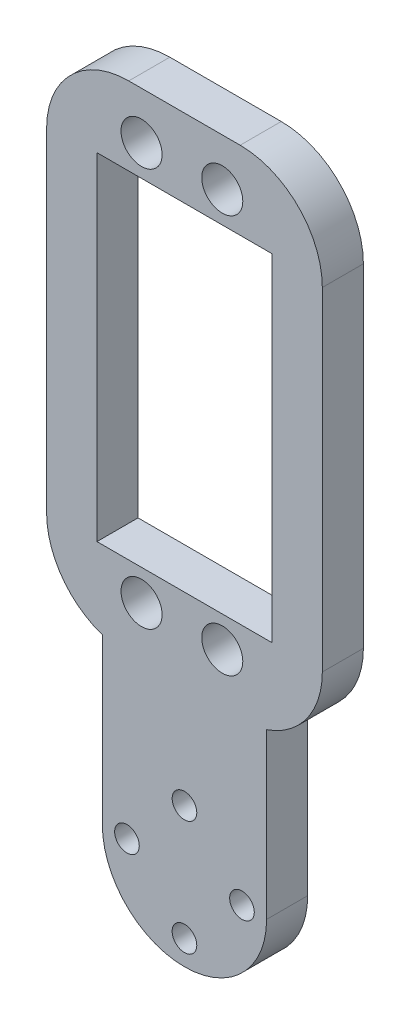
ISO-10303-21;
HEADER;
FILE_DESCRIPTION(('STEP AP214'),'2;1');
FILE_NAME('part.step','',(''),(''),'','','');
FILE_SCHEMA(('AUTOMOTIVE_DESIGN { 1 0 10303 214 1 1 1 1 }'));
ENDSEC;
DATA;
#1=APPLICATION_CONTEXT('core data for automotive mechanical design processes');
#2=APPLICATION_PROTOCOL_DEFINITION('international standard','automotive_design',2000,#1);
#3=PRODUCT_CONTEXT('',#1,'mechanical');
#4=PRODUCT('Part','Part','',(#3));
#5=PRODUCT_RELATED_PRODUCT_CATEGORY('part','',(#4));
#6=PRODUCT_DEFINITION_FORMATION('','',#4);
#7=PRODUCT_DEFINITION_CONTEXT('part definition',#1,'design');
#8=PRODUCT_DEFINITION('design','',#6,#7);
#9=PRODUCT_DEFINITION_SHAPE('','',#8);
#10=(LENGTH_UNIT() NAMED_UNIT(*) SI_UNIT(.MILLI.,.METRE.));
#11=(NAMED_UNIT(*) PLANE_ANGLE_UNIT() SI_UNIT($,.RADIAN.));
#12=(NAMED_UNIT(*) SI_UNIT($,.STERADIAN.) SOLID_ANGLE_UNIT());
#13=UNCERTAINTY_MEASURE_WITH_UNIT(LENGTH_MEASURE(1.E-05),#10,'distance_accuracy_value','');
#14=(GEOMETRIC_REPRESENTATION_CONTEXT(3) GLOBAL_UNCERTAINTY_ASSIGNED_CONTEXT((#13)) GLOBAL_UNIT_ASSIGNED_CONTEXT((#10,
#11,#12)) REPRESENTATION_CONTEXT('',''));
#15=CARTESIAN_POINT('',(0.,0.,0.));
#16=DIRECTION('',(0.,0.,1.));
#17=DIRECTION('',(1.,0.,0.));
#18=AXIS2_PLACEMENT_3D('',#15,#16,#17);
#19=CARTESIAN_POINT('',(-10.,0.,5.));
#20=DIRECTION('',(-1.,0.,0.));
#21=DIRECTION('',(0.,0.,1.));
#22=AXIS2_PLACEMENT_3D('',#19,#20,#21);
#23=PLANE('',#22);
#24=DIRECTION('',(0.,0.,1.));
#25=VECTOR('',#24,1.);
#26=CARTESIAN_POINT('',(-10.,20.,5.));
#27=LINE('',#26,#25);
#28=CARTESIAN_POINT('',(-10.,20.,0.));
#29=VERTEX_POINT('',#28);
#30=CARTESIAN_POINT('',(-10.,20.,5.));
#31=VERTEX_POINT('',#30);
#32=EDGE_CURVE('E210',#29,#31,#27,.T.);
#33=ORIENTED_EDGE('',*,*,#32,.F.);
#34=DIRECTION('',(0.,1.,0.));
#35=VECTOR('',#34,1.);
#36=CARTESIAN_POINT('',(-10.,0.,0.));
#37=LINE('',#36,#35);
#38=CARTESIAN_POINT('',(-10.,0.,0.));
#39=VERTEX_POINT('',#38);
#40=EDGE_CURVE('E241',#39,#29,#37,.T.);
#41=ORIENTED_EDGE('',*,*,#40,.F.);
#42=DIRECTION('',(0.,0.,-1.));
#43=VECTOR('',#42,1.);
#44=CARTESIAN_POINT('',(-10.,0.,5.));
#45=LINE('',#44,#43);
#46=CARTESIAN_POINT('',(-10.,0.,5.));
#47=VERTEX_POINT('',#46);
#48=EDGE_CURVE('E253',#47,#39,#45,.T.);
#49=ORIENTED_EDGE('',*,*,#48,.F.);
#50=DIRECTION('',(0.,1.,0.));
#51=VECTOR('',#50,1.);
#52=CARTESIAN_POINT('',(-10.,0.,5.));
#53=LINE('',#52,#51);
#54=EDGE_CURVE('E228',#47,#31,#53,.T.);
#55=ORIENTED_EDGE('',*,*,#54,.T.);
#56=EDGE_LOOP('',(#33,#41,#49,#55));
#57=FACE_BOUND('',#56,.T.);
#58=ADVANCED_FACE('F36',(#57),#23,.T.);
#59=CARTESIAN_POINT('',(0.,0.,5.));
#60=DIRECTION('',(0.,0.,-1.));
#61=DIRECTION('',(-1.,0.,0.));
#62=AXIS2_PLACEMENT_3D('',#59,#60,#61);
#63=CYLINDRICAL_SURFACE('',#62,10.);
#64=CARTESIAN_POINT('',(0.,0.,0.));
#65=DIRECTION('',(0.,0.,1.));
#66=DIRECTION('',(1.,0.,0.));
#67=AXIS2_PLACEMENT_3D('',#64,#65,#66);
#68=CIRCLE('',#67,10.);
#69=CARTESIAN_POINT('',(10.,0.,0.));
#70=VERTEX_POINT('',#69);
#71=EDGE_CURVE('E244',#39,#70,#68,.T.);
#72=ORIENTED_EDGE('',*,*,#71,.T.);
#73=DIRECTION('',(0.,0.,-1.));
#74=VECTOR('',#73,1.);
#75=CARTESIAN_POINT('',(10.,0.,5.));
#76=LINE('',#75,#74);
#77=CARTESIAN_POINT('',(10.,0.,5.));
#78=VERTEX_POINT('',#77);
#79=EDGE_CURVE('E240',#78,#70,#76,.T.);
#80=ORIENTED_EDGE('',*,*,#79,.F.);
#81=CARTESIAN_POINT('',(0.,0.,5.));
#82=DIRECTION('',(0.,0.,1.));
#83=DIRECTION('',(1.,0.,0.));
#84=AXIS2_PLACEMENT_3D('',#81,#82,#83);
#85=CIRCLE('',#84,10.);
#86=EDGE_CURVE('E231',#47,#78,#85,.T.);
#87=ORIENTED_EDGE('',*,*,#86,.F.);
#88=ORIENTED_EDGE('',*,*,#48,.T.);
#89=EDGE_LOOP('',(#72,#80,#87,#88));
#90=FACE_BOUND('',#89,.T.);
#91=ADVANCED_FACE('F329',(#90),#63,.T.);
#92=CARTESIAN_POINT('',(10.,0.,5.));
#93=DIRECTION('',(-1.,0.,0.));
#94=DIRECTION('',(0.,0.,1.));
#95=AXIS2_PLACEMENT_3D('',#92,#93,#94);
#96=PLANE('',#95);
#97=DIRECTION('',(0.,1.,0.));
#98=VECTOR('',#97,1.);
#99=CARTESIAN_POINT('',(10.,0.,0.));
#100=LINE('',#99,#98);
#101=CARTESIAN_POINT('',(10.,20.,0.));
#102=VERTEX_POINT('',#101);
#103=EDGE_CURVE('E246',#70,#102,#100,.T.);
#104=ORIENTED_EDGE('',*,*,#103,.T.);
#105=DIRECTION('',(0.,0.,1.));
#106=VECTOR('',#105,1.);
#107=CARTESIAN_POINT('',(10.,20.,5.));
#108=LINE('',#107,#106);
#109=CARTESIAN_POINT('',(10.,20.,5.));
#110=VERTEX_POINT('',#109);
#111=EDGE_CURVE('E203',#102,#110,#108,.T.);
#112=ORIENTED_EDGE('',*,*,#111,.T.);
#113=DIRECTION('',(0.,1.,0.));
#114=VECTOR('',#113,1.);
#115=CARTESIAN_POINT('',(10.,0.,5.));
#116=LINE('',#115,#114);
#117=EDGE_CURVE('E234',#78,#110,#116,.T.);
#118=ORIENTED_EDGE('',*,*,#117,.F.);
#119=ORIENTED_EDGE('',*,*,#79,.T.);
#120=EDGE_LOOP('',(#104,#112,#118,#119));
#121=FACE_BOUND('',#120,.T.);
#122=ADVANCED_FACE('F324',(#121),#96,.F.);
#123=CARTESIAN_POINT('',(0.,80.,5.));
#124=DIRECTION('',(0.,1.,0.));
#125=DIRECTION('',(0.,0.,1.));
#126=AXIS2_PLACEMENT_3D('',#123,#124,#125);
#127=PLANE('',#126);
#128=DIRECTION('',(1.,0.,0.));
#129=VECTOR('',#128,1.);
#130=CARTESIAN_POINT('',(0.,80.,5.));
#131=LINE('',#130,#129);
#132=CARTESIAN_POINT('',(-6.78000000000165,80.,5.));
#133=VERTEX_POINT('',#132);
#134=CARTESIAN_POINT('',(6.77999999999835,80.,5.));
#135=VERTEX_POINT('',#134);
#136=EDGE_CURVE('E237',#133,#135,#131,.T.);
#137=ORIENTED_EDGE('',*,*,#136,.T.);
#138=DIRECTION('',(0.,0.,1.));
#139=VECTOR('',#138,1.);
#140=CARTESIAN_POINT('',(6.77999999999835,80.,5.));
#141=LINE('',#140,#139);
#142=CARTESIAN_POINT('',(6.77999999999835,80.,0.));
#143=VERTEX_POINT('',#142);
#144=EDGE_CURVE('E280',#135,#143,#141,.F.);
#145=ORIENTED_EDGE('',*,*,#144,.T.);
#146=DIRECTION('',(1.,0.,0.));
#147=VECTOR('',#146,1.);
#148=CARTESIAN_POINT('',(0.,80.,0.));
#149=LINE('',#148,#147);
#150=CARTESIAN_POINT('',(-6.78000000000165,80.,0.));
#151=VERTEX_POINT('',#150);
#152=EDGE_CURVE('E232',#151,#143,#149,.T.);
#153=ORIENTED_EDGE('',*,*,#152,.F.);
#154=DIRECTION('',(0.,0.,1.));
#155=VECTOR('',#154,1.);
#156=CARTESIAN_POINT('',(-6.78000000000165,80.,5.));
#157=LINE('',#156,#155);
#158=EDGE_CURVE('E277',#151,#133,#157,.T.);
#159=ORIENTED_EDGE('',*,*,#158,.T.);
#160=EDGE_LOOP('',(#137,#145,#153,#159));
#161=FACE_BOUND('',#160,.T.);
#162=ADVANCED_FACE('F303',(#161),#127,.T.);
#163=CARTESIAN_POINT('',(0.,0.,5.));
#164=DIRECTION('',(0.,0.,1.));
#165=DIRECTION('',(1.,0.,0.));
#166=AXIS2_PLACEMENT_3D('',#163,#164,#165);
#167=PLANE('',#166);
#168=DIRECTION('',(1.,0.,0.));
#169=VECTOR('',#168,1.);
#170=CARTESIAN_POINT('',(10.6500000000003,29.5,5.));
#171=LINE('',#170,#169);
#172=CARTESIAN_POINT('',(-10.6499999999997,29.5,5.));
#173=VERTEX_POINT('',#172);
#174=CARTESIAN_POINT('',(10.6500000000003,29.5,5.));
#175=VERTEX_POINT('',#174);
#176=EDGE_CURVE('E51',#173,#175,#171,.T.);
#177=ORIENTED_EDGE('',*,*,#176,.F.);
#178=DIRECTION('',(0.,-1.,0.));
#179=VECTOR('',#178,1.);
#180=CARTESIAN_POINT('',(-10.6499999999997,29.5,5.));
#181=LINE('',#180,#179);
#182=CARTESIAN_POINT('',(-10.6499999999997,70.5,5.));
#183=VERTEX_POINT('',#182);
#184=EDGE_CURVE('E155',#183,#173,#181,.T.);
#185=ORIENTED_EDGE('',*,*,#184,.F.);
#186=DIRECTION('',(-1.,0.,0.));
#187=VECTOR('',#186,1.);
#188=CARTESIAN_POINT('',(10.6500000000003,70.5,5.));
#189=LINE('',#188,#187);
#190=CARTESIAN_POINT('',(10.6500000000003,70.5,5.));
#191=VERTEX_POINT('',#190);
#192=EDGE_CURVE('E158',#191,#183,#189,.T.);
#193=ORIENTED_EDGE('',*,*,#192,.F.);
#194=DIRECTION('',(0.,1.,0.));
#195=VECTOR('',#194,1.);
#196=CARTESIAN_POINT('',(10.6500000000003,29.5,5.));
#197=LINE('',#196,#195);
#198=EDGE_CURVE('E167',#175,#191,#197,.T.);
#199=ORIENTED_EDGE('',*,*,#198,.F.);
#200=EDGE_LOOP('',(#177,#185,#193,#199));
#201=FACE_BOUND('',#200,.T.);
#202=CARTESIAN_POINT('',(4.60000000000069,25.75,5.));
#203=DIRECTION('',(0.,0.,1.));
#204=DIRECTION('',(1.,0.,0.));
#205=AXIS2_PLACEMENT_3D('',#202,#203,#204);
#206=CIRCLE('',#205,2.50000000000012);
#207=CARTESIAN_POINT('',(7.10000000000081,25.75,5.));
#208=VERTEX_POINT('',#207);
#209=EDGE_CURVE('E161',#208,#208,#206,.T.);
#210=ORIENTED_EDGE('',*,*,#209,.F.);
#211=EDGE_LOOP('',(#210));
#212=FACE_BOUND('',#211,.T.);
#213=CARTESIAN_POINT('',(-5.22372370985057,25.75,5.));
#214=DIRECTION('',(0.,0.,1.));
#215=DIRECTION('',(1.,0.,0.));
#216=AXIS2_PLACEMENT_3D('',#213,#214,#215);
#217=CIRCLE('',#216,2.5);
#218=CARTESIAN_POINT('',(-2.72372370985057,25.75,5.));
#219=VERTEX_POINT('',#218);
#220=EDGE_CURVE('E186',#219,#219,#217,.T.);
#221=ORIENTED_EDGE('',*,*,#220,.F.);
#222=EDGE_LOOP('',(#221));
#223=FACE_BOUND('',#222,.T.);
#224=CARTESIAN_POINT('',(-5.22372370985057,74.25,5.));
#225=DIRECTION('',(0.,0.,1.));
#226=DIRECTION('',(1.,0.,0.));
#227=AXIS2_PLACEMENT_3D('',#224,#225,#226);
#228=CIRCLE('',#227,2.49999999999999);
#229=CARTESIAN_POINT('',(-2.72372370985058,74.25,5.));
#230=VERTEX_POINT('',#229);
#231=EDGE_CURVE('E180',#230,#230,#228,.T.);
#232=ORIENTED_EDGE('',*,*,#231,.F.);
#233=EDGE_LOOP('',(#232));
#234=FACE_BOUND('',#233,.T.);
#235=CARTESIAN_POINT('',(4.60000000000069,74.25,5.));
#236=DIRECTION('',(0.,0.,1.));
#237=DIRECTION('',(1.,0.,0.));
#238=AXIS2_PLACEMENT_3D('',#235,#236,#237);
#239=CIRCLE('',#238,2.50000000000001);
#240=CARTESIAN_POINT('',(7.10000000000069,74.25,5.));
#241=VERTEX_POINT('',#240);
#242=EDGE_CURVE('E179',#241,#241,#239,.T.);
#243=ORIENTED_EDGE('',*,*,#242,.F.);
#244=EDGE_LOOP('',(#243));
#245=FACE_BOUND('',#244,.T.);
#246=DIRECTION('',(0.,1.,0.));
#247=VECTOR('',#246,1.);
#248=CARTESIAN_POINT('',(16.7799999999983,80.,5.));
#249=LINE('',#248,#247);
#250=CARTESIAN_POINT('',(16.7799999999983,29.4673966854669,5.));
#251=VERTEX_POINT('',#250);
#252=CARTESIAN_POINT('',(16.7799999999983,70.,5.));
#253=VERTEX_POINT('',#252);
#254=EDGE_CURVE('E193',#251,#253,#249,.T.);
#255=ORIENTED_EDGE('',*,*,#254,.T.);
#256=CARTESIAN_POINT('',(6.77999999999835,70.,5.));
#257=DIRECTION('',(0.,0.,1.));
#258=DIRECTION('',(1.,0.,0.));
#259=AXIS2_PLACEMENT_3D('',#256,#257,#258);
#260=CIRCLE('',#259,10.);
#261=EDGE_CURVE('E275',#253,#135,#260,.T.);
#262=ORIENTED_EDGE('',*,*,#261,.T.);
#263=ORIENTED_EDGE('',*,*,#136,.F.);
#264=CARTESIAN_POINT('',(-6.78000000000165,70.,5.));
#265=DIRECTION('',(0.,0.,1.));
#266=DIRECTION('',(1.,0.,0.));
#267=AXIS2_PLACEMENT_3D('',#264,#265,#266);
#268=CIRCLE('',#267,10.);
#269=CARTESIAN_POINT('',(-16.7800000000017,70.,5.));
#270=VERTEX_POINT('',#269);
#271=EDGE_CURVE('E269',#133,#270,#268,.T.);
#272=ORIENTED_EDGE('',*,*,#271,.T.);
#273=DIRECTION('',(0.,-1.,0.));
#274=VECTOR('',#273,1.);
#275=CARTESIAN_POINT('',(-16.7800000000017,80.,5.));
#276=LINE('',#275,#274);
#277=CARTESIAN_POINT('',(-16.7800000000016,29.467396685468,5.));
#278=VERTEX_POINT('',#277);
#279=EDGE_CURVE('E200',#270,#278,#276,.T.);
#280=ORIENTED_EDGE('',*,*,#279,.T.);
#281=CARTESIAN_POINT('',(-6.78000000000165,29.467396685468,5.));
#282=DIRECTION('',(0.,0.,1.));
#283=DIRECTION('',(1.,0.,0.));
#284=AXIS2_PLACEMENT_3D('',#281,#282,#283);
#285=CIRCLE('',#284,10.);
#286=EDGE_CURVE('E271',#278,#31,#285,.T.);
#287=ORIENTED_EDGE('',*,*,#286,.T.);
#288=ORIENTED_EDGE('',*,*,#54,.F.);
#289=ORIENTED_EDGE('',*,*,#86,.T.);
#290=ORIENTED_EDGE('',*,*,#117,.T.);
#291=CARTESIAN_POINT('',(6.77999999999835,29.4673966854669,5.));
#292=DIRECTION('',(0.,0.,1.));
#293=DIRECTION('',(1.,0.,0.));
#294=AXIS2_PLACEMENT_3D('',#291,#292,#293);
#295=CIRCLE('',#294,10.);
#296=EDGE_CURVE('E273',#110,#251,#295,.T.);
#297=ORIENTED_EDGE('',*,*,#296,.T.);
#298=EDGE_LOOP('',(#255,#262,#263,#272,#280,#287,#288,#289,#290,#297));
#299=FACE_BOUND('',#298,.T.);
#300=CARTESIAN_POINT('',(7.,0.,5.));
#301=DIRECTION('',(0.,0.,1.));
#302=DIRECTION('',(1.,0.,0.));
#303=AXIS2_PLACEMENT_3D('',#300,#301,#302);
#304=CIRCLE('',#303,1.50000000000002);
#305=CARTESIAN_POINT('',(8.50000000000002,0.,5.));
#306=VERTEX_POINT('',#305);
#307=EDGE_CURVE('E214',#306,#306,#304,.T.);
#308=ORIENTED_EDGE('',*,*,#307,.F.);
#309=EDGE_LOOP('',(#308));
#310=FACE_BOUND('',#309,.T.);
#311=CARTESIAN_POINT('',(0.,-7.,5.));
#312=DIRECTION('',(0.,0.,1.));
#313=DIRECTION('',(1.,0.,0.));
#314=AXIS2_PLACEMENT_3D('',#311,#312,#313);
#315=CIRCLE('',#314,1.50000000000005);
#316=CARTESIAN_POINT('',(1.50000000000005,-7.,5.));
#317=VERTEX_POINT('',#316);
#318=EDGE_CURVE('E218',#317,#317,#315,.T.);
#319=ORIENTED_EDGE('',*,*,#318,.F.);
#320=EDGE_LOOP('',(#319));
#321=FACE_BOUND('',#320,.T.);
#322=CARTESIAN_POINT('',(-7.,0.,5.));
#323=DIRECTION('',(0.,0.,1.));
#324=DIRECTION('',(1.,0.,0.));
#325=AXIS2_PLACEMENT_3D('',#322,#323,#324);
#326=CIRCLE('',#325,1.50000000000007);
#327=CARTESIAN_POINT('',(-5.49999999999993,0.,5.));
#328=VERTEX_POINT('',#327);
#329=EDGE_CURVE('E213',#328,#328,#326,.T.);
#330=ORIENTED_EDGE('',*,*,#329,.F.);
#331=EDGE_LOOP('',(#330));
#332=FACE_BOUND('',#331,.T.);
#333=CARTESIAN_POINT('',(0.,7.,5.));
#334=DIRECTION('',(0.,0.,1.));
#335=DIRECTION('',(1.,0.,0.));
#336=AXIS2_PLACEMENT_3D('',#333,#334,#335);
#337=CIRCLE('',#336,1.5);
#338=CARTESIAN_POINT('',(1.5,7.,5.));
#339=VERTEX_POINT('',#338);
#340=EDGE_CURVE('E223',#339,#339,#337,.T.);
#341=ORIENTED_EDGE('',*,*,#340,.F.);
#342=EDGE_LOOP('',(#341));
#343=FACE_BOUND('',#342,.T.);
#344=ADVANCED_FACE('F306',(#201,#212,#223,#234,#245,#299,#310,#321,#332,#343),#167,.T.);
#345=CARTESIAN_POINT('',(0.,0.,0.));
#346=DIRECTION('',(0.,0.,1.));
#347=DIRECTION('',(1.,0.,0.));
#348=AXIS2_PLACEMENT_3D('',#345,#346,#347);
#349=PLANE('',#348);
#350=DIRECTION('',(0.,-1.,0.));
#351=VECTOR('',#350,1.);
#352=CARTESIAN_POINT('',(-10.6499999999997,29.5,0.));
#353=LINE('',#352,#351);
#354=CARTESIAN_POINT('',(-10.6499999999997,70.5,0.));
#355=VERTEX_POINT('',#354);
#356=CARTESIAN_POINT('',(-10.6499999999997,29.5,0.));
#357=VERTEX_POINT('',#356);
#358=EDGE_CURVE('E145',#355,#357,#353,.T.);
#359=ORIENTED_EDGE('',*,*,#358,.T.);
#360=DIRECTION('',(1.,0.,0.));
#361=VECTOR('',#360,1.);
#362=CARTESIAN_POINT('',(10.6500000000003,29.5,0.));
#363=LINE('',#362,#361);
#364=CARTESIAN_POINT('',(10.6500000000003,29.5,0.));
#365=VERTEX_POINT('',#364);
#366=EDGE_CURVE('E139',#357,#365,#363,.T.);
#367=ORIENTED_EDGE('',*,*,#366,.T.);
#368=DIRECTION('',(0.,1.,0.));
#369=VECTOR('',#368,1.);
#370=CARTESIAN_POINT('',(10.6500000000003,29.5,0.));
#371=LINE('',#370,#369);
#372=CARTESIAN_POINT('',(10.6500000000003,70.5,0.));
#373=VERTEX_POINT('',#372);
#374=EDGE_CURVE('E148',#365,#373,#371,.T.);
#375=ORIENTED_EDGE('',*,*,#374,.T.);
#376=DIRECTION('',(-1.,0.,0.));
#377=VECTOR('',#376,1.);
#378=CARTESIAN_POINT('',(10.6500000000003,70.5,0.));
#379=LINE('',#378,#377);
#380=EDGE_CURVE('E59',#373,#355,#379,.T.);
#381=ORIENTED_EDGE('',*,*,#380,.T.);
#382=EDGE_LOOP('',(#359,#367,#375,#381));
#383=FACE_BOUND('',#382,.T.);
#384=CARTESIAN_POINT('',(4.60000000000069,25.75,0.));
#385=DIRECTION('',(0.,0.,1.));
#386=DIRECTION('',(1.,0.,0.));
#387=AXIS2_PLACEMENT_3D('',#384,#385,#386);
#388=CIRCLE('',#387,2.50000000000012);
#389=CARTESIAN_POINT('',(7.10000000000081,25.75,0.));
#390=VERTEX_POINT('',#389);
#391=EDGE_CURVE('E189',#390,#390,#388,.T.);
#392=ORIENTED_EDGE('',*,*,#391,.T.);
#393=EDGE_LOOP('',(#392));
#394=FACE_BOUND('',#393,.T.);
#395=CARTESIAN_POINT('',(-5.22372370985057,25.75,0.));
#396=DIRECTION('',(0.,0.,1.));
#397=DIRECTION('',(1.,0.,0.));
#398=AXIS2_PLACEMENT_3D('',#395,#396,#397);
#399=CIRCLE('',#398,2.5);
#400=CARTESIAN_POINT('',(-2.72372370985057,25.75,0.));
#401=VERTEX_POINT('',#400);
#402=EDGE_CURVE('E183',#401,#401,#399,.T.);
#403=ORIENTED_EDGE('',*,*,#402,.T.);
#404=EDGE_LOOP('',(#403));
#405=FACE_BOUND('',#404,.T.);
#406=CARTESIAN_POINT('',(-5.22372370985057,74.25,0.));
#407=DIRECTION('',(0.,0.,1.));
#408=DIRECTION('',(1.,0.,0.));
#409=AXIS2_PLACEMENT_3D('',#406,#407,#408);
#410=CIRCLE('',#409,2.49999999999999);
#411=CARTESIAN_POINT('',(-2.72372370985058,74.25,0.));
#412=VERTEX_POINT('',#411);
#413=EDGE_CURVE('E176',#412,#412,#410,.T.);
#414=ORIENTED_EDGE('',*,*,#413,.T.);
#415=EDGE_LOOP('',(#414));
#416=FACE_BOUND('',#415,.T.);
#417=CARTESIAN_POINT('',(4.60000000000069,74.25,0.));
#418=DIRECTION('',(0.,0.,1.));
#419=DIRECTION('',(1.,0.,0.));
#420=AXIS2_PLACEMENT_3D('',#417,#418,#419);
#421=CIRCLE('',#420,2.50000000000001);
#422=CARTESIAN_POINT('',(7.10000000000069,74.25,0.));
#423=VERTEX_POINT('',#422);
#424=EDGE_CURVE('E190',#423,#423,#421,.T.);
#425=ORIENTED_EDGE('',*,*,#424,.T.);
#426=EDGE_LOOP('',(#425));
#427=FACE_BOUND('',#426,.T.);
#428=CARTESIAN_POINT('',(7.,0.,0.));
#429=DIRECTION('',(0.,0.,1.));
#430=DIRECTION('',(1.,0.,0.));
#431=AXIS2_PLACEMENT_3D('',#428,#429,#430);
#432=CIRCLE('',#431,1.50000000000002);
#433=CARTESIAN_POINT('',(8.50000000000002,0.,0.));
#434=VERTEX_POINT('',#433);
#435=EDGE_CURVE('E227',#434,#434,#432,.T.);
#436=ORIENTED_EDGE('',*,*,#435,.T.);
#437=EDGE_LOOP('',(#436));
#438=FACE_BOUND('',#437,.T.);
#439=CARTESIAN_POINT('',(0.,-7.,0.));
#440=DIRECTION('',(0.,0.,1.));
#441=DIRECTION('',(1.,0.,0.));
#442=AXIS2_PLACEMENT_3D('',#439,#440,#441);
#443=CIRCLE('',#442,1.50000000000005);
#444=CARTESIAN_POINT('',(1.50000000000005,-7.,0.));
#445=VERTEX_POINT('',#444);
#446=EDGE_CURVE('E260',#445,#445,#443,.T.);
#447=ORIENTED_EDGE('',*,*,#446,.T.);
#448=EDGE_LOOP('',(#447));
#449=FACE_BOUND('',#448,.T.);
#450=CARTESIAN_POINT('',(-7.,0.,0.));
#451=DIRECTION('',(0.,0.,1.));
#452=DIRECTION('',(1.,0.,0.));
#453=AXIS2_PLACEMENT_3D('',#450,#451,#452);
#454=CIRCLE('',#453,1.50000000000007);
#455=CARTESIAN_POINT('',(-5.49999999999993,0.,0.));
#456=VERTEX_POINT('',#455);
#457=EDGE_CURVE('E217',#456,#456,#454,.T.);
#458=ORIENTED_EDGE('',*,*,#457,.T.);
#459=EDGE_LOOP('',(#458));
#460=FACE_BOUND('',#459,.T.);
#461=CARTESIAN_POINT('',(0.,7.,0.));
#462=DIRECTION('',(0.,0.,1.));
#463=DIRECTION('',(1.,0.,0.));
#464=AXIS2_PLACEMENT_3D('',#461,#462,#463);
#465=CIRCLE('',#464,1.5);
#466=CARTESIAN_POINT('',(1.5,7.,0.));
#467=VERTEX_POINT('',#466);
#468=EDGE_CURVE('E226',#467,#467,#465,.T.);
#469=ORIENTED_EDGE('',*,*,#468,.T.);
#470=EDGE_LOOP('',(#469));
#471=FACE_BOUND('',#470,.T.);
#472=ORIENTED_EDGE('',*,*,#152,.T.);
#473=CARTESIAN_POINT('',(6.77999999999835,70.,0.));
#474=DIRECTION('',(0.,0.,1.));
#475=DIRECTION('',(1.,0.,0.));
#476=AXIS2_PLACEMENT_3D('',#473,#474,#475);
#477=CIRCLE('',#476,10.);
#478=CARTESIAN_POINT('',(16.7799999999983,70.,0.));
#479=VERTEX_POINT('',#478);
#480=EDGE_CURVE('E288',#143,#479,#477,.F.);
#481=ORIENTED_EDGE('',*,*,#480,.T.);
#482=DIRECTION('',(0.,1.,0.));
#483=VECTOR('',#482,1.);
#484=CARTESIAN_POINT('',(16.7799999999983,80.,0.));
#485=LINE('',#484,#483);
#486=CARTESIAN_POINT('',(16.7799999999983,29.4673966854669,0.));
#487=VERTEX_POINT('',#486);
#488=EDGE_CURVE('E196',#487,#479,#485,.T.);
#489=ORIENTED_EDGE('',*,*,#488,.F.);
#490=CARTESIAN_POINT('',(6.77999999999835,29.4673966854669,0.));
#491=DIRECTION('',(0.,0.,1.));
#492=DIRECTION('',(1.,0.,0.));
#493=AXIS2_PLACEMENT_3D('',#490,#491,#492);
#494=CIRCLE('',#493,10.);
#495=EDGE_CURVE('E286',#487,#102,#494,.F.);
#496=ORIENTED_EDGE('',*,*,#495,.T.);
#497=ORIENTED_EDGE('',*,*,#103,.F.);
#498=ORIENTED_EDGE('',*,*,#71,.F.);
#499=ORIENTED_EDGE('',*,*,#40,.T.);
#500=CARTESIAN_POINT('',(-6.78000000000165,29.467396685468,0.));
#501=DIRECTION('',(0.,0.,1.));
#502=DIRECTION('',(1.,0.,0.));
#503=AXIS2_PLACEMENT_3D('',#500,#501,#502);
#504=CIRCLE('',#503,10.);
#505=CARTESIAN_POINT('',(-16.7800000000016,29.467396685468,0.));
#506=VERTEX_POINT('',#505);
#507=EDGE_CURVE('E284',#29,#506,#504,.F.);
#508=ORIENTED_EDGE('',*,*,#507,.T.);
#509=DIRECTION('',(0.,-1.,0.));
#510=VECTOR('',#509,1.);
#511=CARTESIAN_POINT('',(-16.7800000000017,80.,0.));
#512=LINE('',#511,#510);
#513=CARTESIAN_POINT('',(-16.7800000000017,70.,0.));
#514=VERTEX_POINT('',#513);
#515=EDGE_CURVE('E199',#514,#506,#512,.T.);
#516=ORIENTED_EDGE('',*,*,#515,.F.);
#517=CARTESIAN_POINT('',(-6.78000000000165,70.,0.));
#518=DIRECTION('',(0.,0.,1.));
#519=DIRECTION('',(1.,0.,0.));
#520=AXIS2_PLACEMENT_3D('',#517,#518,#519);
#521=CIRCLE('',#520,10.);
#522=EDGE_CURVE('E282',#514,#151,#521,.F.);
#523=ORIENTED_EDGE('',*,*,#522,.T.);
#524=EDGE_LOOP('',(#472,#481,#489,#496,#497,#498,#499,#508,#516,#523));
#525=FACE_BOUND('',#524,.T.);
#526=ADVANCED_FACE('F152',(#383,#394,#405,#416,#427,#438,#449,#460,#471,#525),#349,.F.);
#527=CARTESIAN_POINT('',(0.,7.,-5.));
#528=DIRECTION('',(0.,0.,1.));
#529=DIRECTION('',(1.,0.,0.));
#530=AXIS2_PLACEMENT_3D('',#527,#528,#529);
#531=CYLINDRICAL_SURFACE('',#530,1.5);
#532=ORIENTED_EDGE('',*,*,#340,.T.);
#533=EDGE_LOOP('',(#532));
#534=FACE_BOUND('',#533,.T.);
#535=ORIENTED_EDGE('',*,*,#468,.F.);
#536=EDGE_LOOP('',(#535));
#537=FACE_BOUND('',#536,.T.);
#538=ADVANCED_FACE('F373',(#534,#537),#531,.F.);
#539=CARTESIAN_POINT('',(-7.,0.,-5.));
#540=DIRECTION('',(0.,0.,1.));
#541=DIRECTION('',(1.,0.,0.));
#542=AXIS2_PLACEMENT_3D('',#539,#540,#541);
#543=CYLINDRICAL_SURFACE('',#542,1.50000000000007);
#544=ORIENTED_EDGE('',*,*,#329,.T.);
#545=EDGE_LOOP('',(#544));
#546=FACE_BOUND('',#545,.T.);
#547=ORIENTED_EDGE('',*,*,#457,.F.);
#548=EDGE_LOOP('',(#547));
#549=FACE_BOUND('',#548,.T.);
#550=ADVANCED_FACE('F369',(#546,#549),#543,.F.);
#551=CARTESIAN_POINT('',(0.,-7.,-5.));
#552=DIRECTION('',(0.,0.,1.));
#553=DIRECTION('',(1.,0.,0.));
#554=AXIS2_PLACEMENT_3D('',#551,#552,#553);
#555=CYLINDRICAL_SURFACE('',#554,1.50000000000005);
#556=ORIENTED_EDGE('',*,*,#318,.T.);
#557=EDGE_LOOP('',(#556));
#558=FACE_BOUND('',#557,.T.);
#559=ORIENTED_EDGE('',*,*,#446,.F.);
#560=EDGE_LOOP('',(#559));
#561=FACE_BOUND('',#560,.T.);
#562=ADVANCED_FACE('F365',(#558,#561),#555,.F.);
#563=CARTESIAN_POINT('',(7.,0.,-5.));
#564=DIRECTION('',(0.,0.,1.));
#565=DIRECTION('',(1.,0.,0.));
#566=AXIS2_PLACEMENT_3D('',#563,#564,#565);
#567=CYLINDRICAL_SURFACE('',#566,1.50000000000002);
#568=ORIENTED_EDGE('',*,*,#307,.T.);
#569=EDGE_LOOP('',(#568));
#570=FACE_BOUND('',#569,.T.);
#571=ORIENTED_EDGE('',*,*,#435,.F.);
#572=EDGE_LOOP('',(#571));
#573=FACE_BOUND('',#572,.T.);
#574=ADVANCED_FACE('F358',(#570,#573),#567,.F.);
#575=CARTESIAN_POINT('',(16.7799999999983,80.,0.));
#576=DIRECTION('',(1.,0.,0.));
#577=DIRECTION('',(0.,1.,0.));
#578=AXIS2_PLACEMENT_3D('',#575,#576,#577);
#579=PLANE('',#578);
#580=ORIENTED_EDGE('',*,*,#488,.T.);
#581=DIRECTION('',(0.,0.,1.));
#582=VECTOR('',#581,1.);
#583=CARTESIAN_POINT('',(16.7799999999983,70.,0.));
#584=LINE('',#583,#582);
#585=EDGE_CURVE('E266',#479,#253,#584,.T.);
#586=ORIENTED_EDGE('',*,*,#585,.T.);
#587=ORIENTED_EDGE('',*,*,#254,.F.);
#588=DIRECTION('',(0.,0.,1.));
#589=VECTOR('',#588,1.);
#590=CARTESIAN_POINT('',(16.7799999999983,29.4673966854669,0.));
#591=LINE('',#590,#589);
#592=EDGE_CURVE('E255',#251,#487,#591,.F.);
#593=ORIENTED_EDGE('',*,*,#592,.T.);
#594=EDGE_LOOP('',(#580,#586,#587,#593));
#595=FACE_BOUND('',#594,.T.);
#596=ADVANCED_FACE('F314',(#595),#579,.T.);
#597=CARTESIAN_POINT('',(-16.7800000000017,80.,0.));
#598=DIRECTION('',(-1.,0.,0.));
#599=DIRECTION('',(0.,-1.,0.));
#600=AXIS2_PLACEMENT_3D('',#597,#598,#599);
#601=PLANE('',#600);
#602=ORIENTED_EDGE('',*,*,#515,.T.);
#603=DIRECTION('',(0.,0.,1.));
#604=VECTOR('',#603,1.);
#605=CARTESIAN_POINT('',(-16.7800000000016,29.467396685468,5.));
#606=LINE('',#605,#604);
#607=EDGE_CURVE('E11',#506,#278,#606,.T.);
#608=ORIENTED_EDGE('',*,*,#607,.T.);
#609=ORIENTED_EDGE('',*,*,#279,.F.);
#610=DIRECTION('',(0.,0.,1.));
#611=VECTOR('',#610,1.);
#612=CARTESIAN_POINT('',(-16.7800000000017,70.,0.));
#613=LINE('',#612,#611);
#614=EDGE_CURVE('E44',#270,#514,#613,.F.);
#615=ORIENTED_EDGE('',*,*,#614,.T.);
#616=EDGE_LOOP('',(#602,#608,#609,#615));
#617=FACE_BOUND('',#616,.T.);
#618=ADVANCED_FACE('F293',(#617),#601,.T.);
#619=CARTESIAN_POINT('',(6.77999999999835,70.,0.));
#620=DIRECTION('',(0.,0.,1.));
#621=DIRECTION('',(1.,0.,0.));
#622=AXIS2_PLACEMENT_3D('',#619,#620,#621);
#623=CYLINDRICAL_SURFACE('',#622,10.);
#624=ORIENTED_EDGE('',*,*,#480,.F.);
#625=ORIENTED_EDGE('',*,*,#144,.F.);
#626=ORIENTED_EDGE('',*,*,#261,.F.);
#627=ORIENTED_EDGE('',*,*,#585,.F.);
#628=EDGE_LOOP('',(#624,#625,#626,#627));
#629=FACE_BOUND('',#628,.T.);
#630=ADVANCED_FACE('F312',(#629),#623,.T.);
#631=CARTESIAN_POINT('',(6.77999999999835,29.4673966854669,0.));
#632=DIRECTION('',(0.,0.,-1.));
#633=DIRECTION('',(-1.,0.,0.));
#634=AXIS2_PLACEMENT_3D('',#631,#632,#633);
#635=CYLINDRICAL_SURFACE('',#634,10.);
#636=ORIENTED_EDGE('',*,*,#495,.F.);
#637=ORIENTED_EDGE('',*,*,#592,.F.);
#638=ORIENTED_EDGE('',*,*,#296,.F.);
#639=ORIENTED_EDGE('',*,*,#111,.F.);
#640=EDGE_LOOP('',(#636,#637,#638,#639));
#641=FACE_BOUND('',#640,.T.);
#642=ADVANCED_FACE('F321',(#641),#635,.T.);
#643=CARTESIAN_POINT('',(-6.78000000000165,29.467396685468,0.));
#644=DIRECTION('',(0.,0.,-1.));
#645=DIRECTION('',(-1.,0.,0.));
#646=AXIS2_PLACEMENT_3D('',#643,#644,#645);
#647=CYLINDRICAL_SURFACE('',#646,10.);
#648=ORIENTED_EDGE('',*,*,#507,.F.);
#649=ORIENTED_EDGE('',*,*,#32,.T.);
#650=ORIENTED_EDGE('',*,*,#286,.F.);
#651=ORIENTED_EDGE('',*,*,#607,.F.);
#652=EDGE_LOOP('',(#648,#649,#650,#651));
#653=FACE_BOUND('',#652,.T.);
#654=ADVANCED_FACE('F334',(#653),#647,.T.);
#655=CARTESIAN_POINT('',(-6.78000000000165,70.,5.));
#656=DIRECTION('',(0.,0.,1.));
#657=DIRECTION('',(1.,0.,0.));
#658=AXIS2_PLACEMENT_3D('',#655,#656,#657);
#659=CYLINDRICAL_SURFACE('',#658,10.);
#660=ORIENTED_EDGE('',*,*,#522,.F.);
#661=ORIENTED_EDGE('',*,*,#614,.F.);
#662=ORIENTED_EDGE('',*,*,#271,.F.);
#663=ORIENTED_EDGE('',*,*,#158,.F.);
#664=EDGE_LOOP('',(#660,#661,#662,#663));
#665=FACE_BOUND('',#664,.T.);
#666=ADVANCED_FACE('F38',(#665),#659,.T.);
#667=CARTESIAN_POINT('',(4.60000000000069,74.25,0.));
#668=DIRECTION('',(0.,0.,1.));
#669=DIRECTION('',(1.,0.,0.));
#670=AXIS2_PLACEMENT_3D('',#667,#668,#669);
#671=CYLINDRICAL_SURFACE('',#670,2.50000000000001);
#672=ORIENTED_EDGE('',*,*,#424,.F.);
#673=EDGE_LOOP('',(#672));
#674=FACE_BOUND('',#673,.T.);
#675=ORIENTED_EDGE('',*,*,#242,.T.);
#676=EDGE_LOOP('',(#675));
#677=FACE_BOUND('',#676,.T.);
#678=ADVANCED_FACE('F340',(#674,#677),#671,.F.);
#679=CARTESIAN_POINT('',(-5.22372370985057,74.25,0.));
#680=DIRECTION('',(0.,0.,1.));
#681=DIRECTION('',(1.,0.,0.));
#682=AXIS2_PLACEMENT_3D('',#679,#680,#681);
#683=CYLINDRICAL_SURFACE('',#682,2.49999999999999);
#684=ORIENTED_EDGE('',*,*,#413,.F.);
#685=EDGE_LOOP('',(#684));
#686=FACE_BOUND('',#685,.T.);
#687=ORIENTED_EDGE('',*,*,#231,.T.);
#688=EDGE_LOOP('',(#687));
#689=FACE_BOUND('',#688,.T.);
#690=ADVANCED_FACE('F454',(#686,#689),#683,.F.);
#691=CARTESIAN_POINT('',(-5.22372370985057,25.75,0.));
#692=DIRECTION('',(0.,0.,1.));
#693=DIRECTION('',(1.,0.,0.));
#694=AXIS2_PLACEMENT_3D('',#691,#692,#693);
#695=CYLINDRICAL_SURFACE('',#694,2.5);
#696=ORIENTED_EDGE('',*,*,#402,.F.);
#697=EDGE_LOOP('',(#696));
#698=FACE_BOUND('',#697,.T.);
#699=ORIENTED_EDGE('',*,*,#220,.T.);
#700=EDGE_LOOP('',(#699));
#701=FACE_BOUND('',#700,.T.);
#702=ADVANCED_FACE('F460',(#698,#701),#695,.F.);
#703=CARTESIAN_POINT('',(4.60000000000069,25.75,0.));
#704=DIRECTION('',(0.,0.,1.));
#705=DIRECTION('',(1.,0.,0.));
#706=AXIS2_PLACEMENT_3D('',#703,#704,#705);
#707=CYLINDRICAL_SURFACE('',#706,2.50000000000012);
#708=ORIENTED_EDGE('',*,*,#391,.F.);
#709=EDGE_LOOP('',(#708));
#710=FACE_BOUND('',#709,.T.);
#711=ORIENTED_EDGE('',*,*,#209,.T.);
#712=EDGE_LOOP('',(#711));
#713=FACE_BOUND('',#712,.T.);
#714=ADVANCED_FACE('F468',(#710,#713),#707,.F.);
#715=CARTESIAN_POINT('',(10.6500000000003,29.5,0.));
#716=DIRECTION('',(0.,-1.,0.));
#717=DIRECTION('',(1.,0.,0.));
#718=AXIS2_PLACEMENT_3D('',#715,#716,#717);
#719=PLANE('',#718);
#720=ORIENTED_EDGE('',*,*,#176,.T.);
#721=DIRECTION('',(0.,0.,1.));
#722=VECTOR('',#721,1.);
#723=CARTESIAN_POINT('',(10.6500000000003,29.5,0.));
#724=LINE('',#723,#722);
#725=EDGE_CURVE('E135',#365,#175,#724,.T.);
#726=ORIENTED_EDGE('',*,*,#725,.F.);
#727=ORIENTED_EDGE('',*,*,#366,.F.);
#728=DIRECTION('',(0.,0.,1.));
#729=VECTOR('',#728,1.);
#730=CARTESIAN_POINT('',(-10.6499999999997,29.5,0.));
#731=LINE('',#730,#729);
#732=EDGE_CURVE('E171',#357,#173,#731,.T.);
#733=ORIENTED_EDGE('',*,*,#732,.T.);
#734=EDGE_LOOP('',(#720,#726,#727,#733));
#735=FACE_BOUND('',#734,.T.);
#736=ADVANCED_FACE('F137',(#735),#719,.F.);
#737=CARTESIAN_POINT('',(-10.6499999999997,29.5,0.));
#738=DIRECTION('',(-1.,0.,0.));
#739=DIRECTION('',(0.,-1.,0.));
#740=AXIS2_PLACEMENT_3D('',#737,#738,#739);
#741=PLANE('',#740);
#742=ORIENTED_EDGE('',*,*,#184,.T.);
#743=ORIENTED_EDGE('',*,*,#732,.F.);
#744=ORIENTED_EDGE('',*,*,#358,.F.);
#745=DIRECTION('',(0.,0.,1.));
#746=VECTOR('',#745,1.);
#747=CARTESIAN_POINT('',(-10.6499999999997,70.5,0.));
#748=LINE('',#747,#746);
#749=EDGE_CURVE('E173',#355,#183,#748,.T.);
#750=ORIENTED_EDGE('',*,*,#749,.T.);
#751=EDGE_LOOP('',(#742,#743,#744,#750));
#752=FACE_BOUND('',#751,.T.);
#753=ADVANCED_FACE('F482',(#752),#741,.F.);
#754=CARTESIAN_POINT('',(10.6500000000003,70.5,0.));
#755=DIRECTION('',(0.,1.,0.));
#756=DIRECTION('',(-1.,0.,0.));
#757=AXIS2_PLACEMENT_3D('',#754,#755,#756);
#758=PLANE('',#757);
#759=ORIENTED_EDGE('',*,*,#192,.T.);
#760=ORIENTED_EDGE('',*,*,#749,.F.);
#761=ORIENTED_EDGE('',*,*,#380,.F.);
#762=DIRECTION('',(0.,0.,1.));
#763=VECTOR('',#762,1.);
#764=CARTESIAN_POINT('',(10.6500000000003,70.5,0.));
#765=LINE('',#764,#763);
#766=EDGE_CURVE('E144',#373,#191,#765,.T.);
#767=ORIENTED_EDGE('',*,*,#766,.T.);
#768=EDGE_LOOP('',(#759,#760,#761,#767));
#769=FACE_BOUND('',#768,.T.);
#770=ADVANCED_FACE('F489',(#769),#758,.F.);
#771=CARTESIAN_POINT('',(10.6500000000003,29.5,0.));
#772=DIRECTION('',(1.,0.,0.));
#773=DIRECTION('',(0.,1.,0.));
#774=AXIS2_PLACEMENT_3D('',#771,#772,#773);
#775=PLANE('',#774);
#776=ORIENTED_EDGE('',*,*,#198,.T.);
#777=ORIENTED_EDGE('',*,*,#766,.F.);
#778=ORIENTED_EDGE('',*,*,#374,.F.);
#779=ORIENTED_EDGE('',*,*,#725,.T.);
#780=EDGE_LOOP('',(#776,#777,#778,#779));
#781=FACE_BOUND('',#780,.T.);
#782=ADVANCED_FACE('F149',(#781),#775,.F.);
#783=CLOSED_SHELL('',(#58,#91,#122,#162,#344,#526,#538,#550,#562,#574,#596,#618,#630,#642,#654,
#666,#678,#690,#702,#714,#736,#753,#770,#782));
#784=MANIFOLD_SOLID_BREP('B2',#783);
#785=ADVANCED_BREP_SHAPE_REPRESENTATION('',(#18,#784),#14);
#786=SHAPE_DEFINITION_REPRESENTATION(#9,#785);
ENDSEC;
END-ISO-10303-21;
